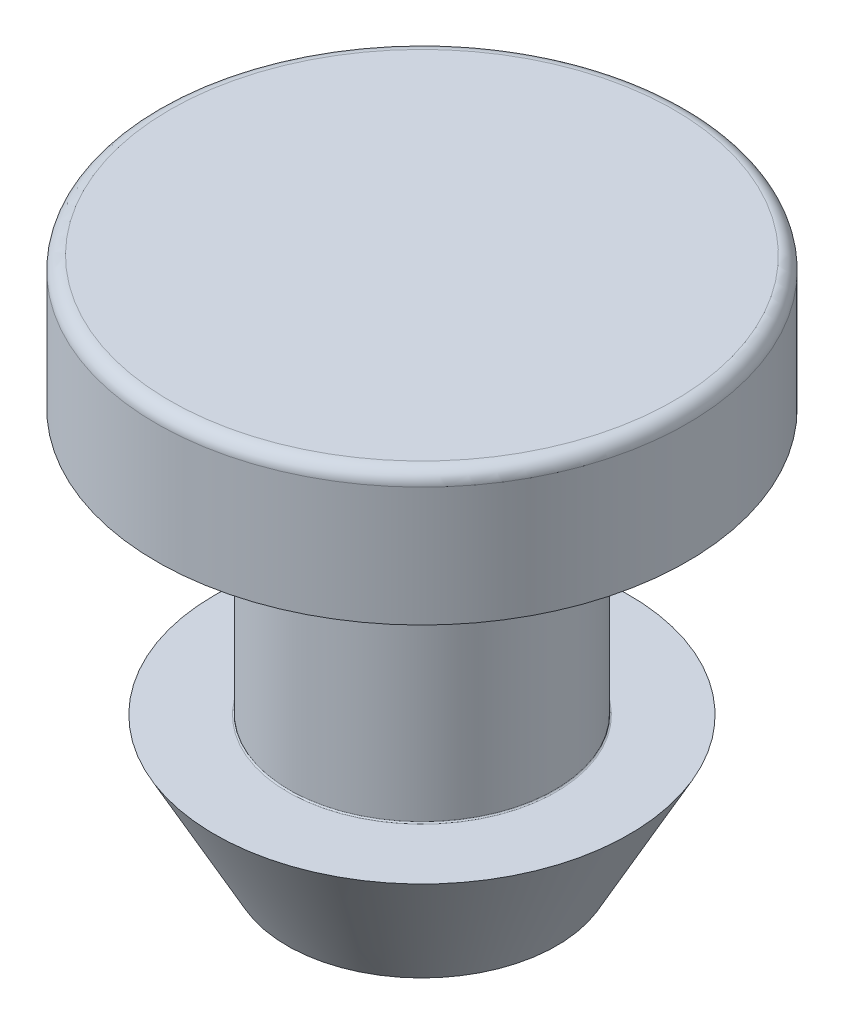
ISO-10303-21;
HEADER;
FILE_DESCRIPTION(('STEP AP214'),'2;1');
FILE_NAME('part.step','',(''),(''),'','','');
FILE_SCHEMA(('AUTOMOTIVE_DESIGN { 1 0 10303 214 1 1 1 1 }'));
ENDSEC;
DATA;
#1=APPLICATION_CONTEXT('core data for automotive mechanical design processes');
#2=APPLICATION_PROTOCOL_DEFINITION('international standard','automotive_design',2000,#1);
#3=PRODUCT_CONTEXT('',#1,'mechanical');
#4=PRODUCT('Part','Part','',(#3));
#5=PRODUCT_RELATED_PRODUCT_CATEGORY('part','',(#4));
#6=PRODUCT_DEFINITION_FORMATION('','',#4);
#7=PRODUCT_DEFINITION_CONTEXT('part definition',#1,'design');
#8=PRODUCT_DEFINITION('design','',#6,#7);
#9=PRODUCT_DEFINITION_SHAPE('','',#8);
#10=(LENGTH_UNIT() NAMED_UNIT(*) SI_UNIT(.MILLI.,.METRE.));
#11=(NAMED_UNIT(*) PLANE_ANGLE_UNIT() SI_UNIT($,.RADIAN.));
#12=(NAMED_UNIT(*) SI_UNIT($,.STERADIAN.) SOLID_ANGLE_UNIT());
#13=UNCERTAINTY_MEASURE_WITH_UNIT(LENGTH_MEASURE(1.E-05),#10,'distance_accuracy_value','');
#14=(GEOMETRIC_REPRESENTATION_CONTEXT(3) GLOBAL_UNCERTAINTY_ASSIGNED_CONTEXT((#13)) GLOBAL_UNIT_ASSIGNED_CONTEXT((#10,
#11,#12)) REPRESENTATION_CONTEXT('',''));
#15=CARTESIAN_POINT('',(0.,0.,0.));
#16=DIRECTION('',(0.,0.,1.));
#17=DIRECTION('',(1.,0.,0.));
#18=AXIS2_PLACEMENT_3D('',#15,#16,#17);
#19=CARTESIAN_POINT('',(6.0325,3.175,0.));
#20=DIRECTION('',(0.,-1.,0.));
#21=DIRECTION('',(1.,0.,0.));
#22=AXIS2_PLACEMENT_3D('',#19,#20,#21);
#23=PLANE('',#22);
#24=CARTESIAN_POINT('',(0.,3.175,0.));
#25=DIRECTION('',(0.,1.,0.));
#26=DIRECTION('',(-1.,0.,0.));
#27=AXIS2_PLACEMENT_3D('',#24,#25,#26);
#28=CIRCLE('',#27,6.0325);
#29=CARTESIAN_POINT('',(-6.0325,3.175,0.));
#30=VERTEX_POINT('',#29);
#31=EDGE_CURVE('E64',#30,#30,#28,.T.);
#32=ORIENTED_EDGE('',*,*,#31,.T.);
#33=EDGE_LOOP('',(#32));
#34=FACE_BOUND('',#33,.T.);
#35=ADVANCED_FACE('F33',(#34),#23,.F.);
#36=CARTESIAN_POINT('',(3.224609375,-9.525,0.));
#37=DIRECTION('',(0.,1.,0.));
#38=DIRECTION('',(-1.,0.,0.));
#39=AXIS2_PLACEMENT_3D('',#36,#37,#38);
#40=PLANE('',#39);
#41=CARTESIAN_POINT('',(0.,-9.525,2.28203125));
#42=DIRECTION('',(0.,-1.,0.));
#43=DIRECTION('',(1.,0.,0.));
#44=AXIS2_PLACEMENT_3D('',#41,#42,#43);
#45=CIRCLE('',#44,0.347265625);
#46=CARTESIAN_POINT('',(0.347265625000001,-9.525,2.28203125));
#47=VERTEX_POINT('',#46);
#48=EDGE_CURVE('E80',#47,#47,#45,.T.);
#49=ORIENTED_EDGE('',*,*,#48,.F.);
#50=EDGE_LOOP('',(#49));
#51=FACE_BOUND('',#50,.T.);
#52=CARTESIAN_POINT('',(1.97629703472996,-9.525,-1.141015625));
#53=DIRECTION('',(0.,-1.,0.));
#54=DIRECTION('',(1.,0.,0.));
#55=AXIS2_PLACEMENT_3D('',#52,#53,#54);
#56=CIRCLE('',#55,0.347265625);
#57=CARTESIAN_POINT('',(2.32356265972996,-9.525,-1.141015625));
#58=VERTEX_POINT('',#57);
#59=EDGE_CURVE('E74',#58,#58,#56,.T.);
#60=ORIENTED_EDGE('',*,*,#59,.F.);
#61=EDGE_LOOP('',(#60));
#62=FACE_BOUND('',#61,.T.);
#63=CARTESIAN_POINT('',(-1.97629703472996,-9.525,-1.141015625));
#64=DIRECTION('',(0.,-1.,0.));
#65=DIRECTION('',(1.,0.,0.));
#66=AXIS2_PLACEMENT_3D('',#63,#64,#65);
#67=CIRCLE('',#66,0.347265625);
#68=CARTESIAN_POINT('',(-1.62903140972996,-9.525,-1.141015625));
#69=VERTEX_POINT('',#68);
#70=EDGE_CURVE('E68',#69,#69,#67,.T.);
#71=ORIENTED_EDGE('',*,*,#70,.F.);
#72=EDGE_LOOP('',(#71));
#73=FACE_BOUND('',#72,.T.);
#74=CARTESIAN_POINT('',(0.,-9.525,0.));
#75=DIRECTION('',(0.,1.,0.));
#76=DIRECTION('',(-1.,0.,0.));
#77=AXIS2_PLACEMENT_3D('',#74,#75,#76);
#78=CIRCLE('',#77,3.224609375);
#79=CARTESIAN_POINT('',(-3.224609375,-9.525,0.));
#80=VERTEX_POINT('',#79);
#81=EDGE_CURVE('E10',#80,#80,#78,.T.);
#82=ORIENTED_EDGE('',*,*,#81,.F.);
#83=EDGE_LOOP('',(#82));
#84=FACE_BOUND('',#83,.T.);
#85=ADVANCED_FACE('F95',(#51,#62,#73,#84),#40,.F.);
#86=CARTESIAN_POINT('',(0.,-9.525,0.));
#87=DIRECTION('',(0.,1.,0.));
#88=DIRECTION('',(-1.,0.,0.));
#89=AXIS2_PLACEMENT_3D('',#86,#87,#88);
#90=CONICAL_SURFACE('',#89,3.224609375,0.500440813147294);
#91=CARTESIAN_POINT('',(0.,-6.35,0.));
#92=DIRECTION('',(0.,1.,0.));
#93=DIRECTION('',(-1.,0.,0.));
#94=AXIS2_PLACEMENT_3D('',#91,#92,#93);
#95=CIRCLE('',#94,4.9609375);
#96=CARTESIAN_POINT('',(-4.9609375,-6.35,0.));
#97=VERTEX_POINT('',#96);
#98=EDGE_CURVE('E39',#97,#97,#95,.T.);
#99=ORIENTED_EDGE('',*,*,#98,.F.);
#100=EDGE_LOOP('',(#99));
#101=FACE_BOUND('',#100,.T.);
#102=ORIENTED_EDGE('',*,*,#81,.T.);
#103=EDGE_LOOP('',(#102));
#104=FACE_BOUND('',#103,.T.);
#105=ADVANCED_FACE('F98',(#101,#104),#90,.T.);
#106=CARTESIAN_POINT('',(3.20675,-6.35,0.));
#107=DIRECTION('',(0.,-1.,0.));
#108=DIRECTION('',(1.,0.,0.));
#109=AXIS2_PLACEMENT_3D('',#106,#107,#108);
#110=PLANE('',#109);
#111=CARTESIAN_POINT('',(0.,-6.35,0.));
#112=DIRECTION('',(0.,1.,0.));
#113=DIRECTION('',(-1.,0.,0.));
#114=AXIS2_PLACEMENT_3D('',#111,#112,#113);
#115=CIRCLE('',#114,3.20675);
#116=CARTESIAN_POINT('',(-3.20675,-6.35,0.));
#117=VERTEX_POINT('',#116);
#118=EDGE_CURVE('E43',#117,#117,#115,.T.);
#119=ORIENTED_EDGE('',*,*,#118,.F.);
#120=EDGE_LOOP('',(#119));
#121=FACE_BOUND('',#120,.T.);
#122=ORIENTED_EDGE('',*,*,#98,.T.);
#123=EDGE_LOOP('',(#122));
#124=FACE_BOUND('',#123,.T.);
#125=ADVANCED_FACE('F155',(#121,#124),#110,.F.);
#126=CARTESIAN_POINT('',(0.,-6.31825,0.));
#127=DIRECTION('',(0.,1.,0.));
#128=DIRECTION('',(-1.,0.,0.));
#129=AXIS2_PLACEMENT_3D('',#126,#127,#128);
#130=TOROIDAL_SURFACE('',#129,3.20675,0.0317500000000003);
#131=CARTESIAN_POINT('',(0.,-6.31825,0.));
#132=DIRECTION('',(0.,1.,0.));
#133=DIRECTION('',(-1.,0.,0.));
#134=AXIS2_PLACEMENT_3D('',#131,#132,#133);
#135=CIRCLE('',#134,3.175);
#136=CARTESIAN_POINT('',(-3.175,-6.31825,0.));
#137=VERTEX_POINT('',#136);
#138=EDGE_CURVE('E47',#137,#137,#135,.T.);
#139=ORIENTED_EDGE('',*,*,#138,.F.);
#140=EDGE_LOOP('',(#139));
#141=FACE_BOUND('',#140,.T.);
#142=ORIENTED_EDGE('',*,*,#118,.T.);
#143=EDGE_LOOP('',(#142));
#144=FACE_BOUND('',#143,.T.);
#145=ADVANCED_FACE('F149',(#141,#144),#130,.F.);
#146=CARTESIAN_POINT('',(0.,3.175,0.));
#147=DIRECTION('',(0.,1.,0.));
#148=DIRECTION('',(-1.,0.,0.));
#149=AXIS2_PLACEMENT_3D('',#146,#147,#148);
#150=CYLINDRICAL_SURFACE('',#149,3.175);
#151=CARTESIAN_POINT('',(0.,-0.031750000000001,0.));
#152=DIRECTION('',(0.,1.,0.));
#153=DIRECTION('',(-1.,0.,0.));
#154=AXIS2_PLACEMENT_3D('',#151,#152,#153);
#155=CIRCLE('',#154,3.175);
#156=CARTESIAN_POINT('',(-3.175,-0.0317500000000012,0.));
#157=VERTEX_POINT('',#156);
#158=EDGE_CURVE('E52',#157,#157,#155,.T.);
#159=ORIENTED_EDGE('',*,*,#158,.F.);
#160=EDGE_LOOP('',(#159));
#161=FACE_BOUND('',#160,.T.);
#162=ORIENTED_EDGE('',*,*,#138,.T.);
#163=EDGE_LOOP('',(#162));
#164=FACE_BOUND('',#163,.T.);
#165=ADVANCED_FACE('F143',(#161,#164),#150,.T.);
#166=CARTESIAN_POINT('',(0.,-0.0317500000000008,0.));
#167=DIRECTION('',(0.,1.,0.));
#168=DIRECTION('',(-1.,0.,0.));
#169=AXIS2_PLACEMENT_3D('',#166,#167,#168);
#170=TOROIDAL_SURFACE('',#169,3.20675,0.0317500000000001);
#171=CARTESIAN_POINT('',(0.,0.,0.));
#172=DIRECTION('',(0.,1.,0.));
#173=DIRECTION('',(-1.,0.,0.));
#174=AXIS2_PLACEMENT_3D('',#171,#172,#173);
#175=CIRCLE('',#174,3.20675);
#176=CARTESIAN_POINT('',(-3.20675,0.,0.));
#177=VERTEX_POINT('',#176);
#178=EDGE_CURVE('E55',#177,#177,#175,.T.);
#179=ORIENTED_EDGE('',*,*,#178,.F.);
#180=EDGE_LOOP('',(#179));
#181=FACE_BOUND('',#180,.T.);
#182=ORIENTED_EDGE('',*,*,#158,.T.);
#183=EDGE_LOOP('',(#182));
#184=FACE_BOUND('',#183,.T.);
#185=ADVANCED_FACE('F137',(#181,#184),#170,.F.);
#186=CARTESIAN_POINT('',(6.35,0.,0.));
#187=DIRECTION('',(0.,1.,0.));
#188=DIRECTION('',(-1.,0.,0.));
#189=AXIS2_PLACEMENT_3D('',#186,#187,#188);
#190=PLANE('',#189);
#191=CARTESIAN_POINT('',(0.,0.,0.));
#192=DIRECTION('',(0.,1.,0.));
#193=DIRECTION('',(-1.,0.,0.));
#194=AXIS2_PLACEMENT_3D('',#191,#192,#193);
#195=CIRCLE('',#194,6.35);
#196=CARTESIAN_POINT('',(-6.35,0.,0.));
#197=VERTEX_POINT('',#196);
#198=EDGE_CURVE('E58',#197,#197,#195,.T.);
#199=ORIENTED_EDGE('',*,*,#198,.F.);
#200=EDGE_LOOP('',(#199));
#201=FACE_BOUND('',#200,.T.);
#202=ORIENTED_EDGE('',*,*,#178,.T.);
#203=EDGE_LOOP('',(#202));
#204=FACE_BOUND('',#203,.T.);
#205=ADVANCED_FACE('F131',(#201,#204),#190,.F.);
#206=CARTESIAN_POINT('',(0.,3.175,0.));
#207=DIRECTION('',(0.,1.,0.));
#208=DIRECTION('',(-1.,0.,0.));
#209=AXIS2_PLACEMENT_3D('',#206,#207,#208);
#210=CYLINDRICAL_SURFACE('',#209,6.35);
#211=CARTESIAN_POINT('',(0.,2.8575,0.));
#212=DIRECTION('',(0.,1.,0.));
#213=DIRECTION('',(-1.,0.,0.));
#214=AXIS2_PLACEMENT_3D('',#211,#212,#213);
#215=CIRCLE('',#214,6.35);
#216=CARTESIAN_POINT('',(-6.35,2.8575,0.));
#217=VERTEX_POINT('',#216);
#218=EDGE_CURVE('E61',#217,#217,#215,.T.);
#219=ORIENTED_EDGE('',*,*,#218,.F.);
#220=EDGE_LOOP('',(#219));
#221=FACE_BOUND('',#220,.T.);
#222=ORIENTED_EDGE('',*,*,#198,.T.);
#223=EDGE_LOOP('',(#222));
#224=FACE_BOUND('',#223,.T.);
#225=ADVANCED_FACE('F117',(#221,#224),#210,.T.);
#226=CARTESIAN_POINT('',(0.,2.8575,0.));
#227=DIRECTION('',(0.,1.,0.));
#228=DIRECTION('',(-1.,0.,0.));
#229=AXIS2_PLACEMENT_3D('',#226,#227,#228);
#230=TOROIDAL_SURFACE('',#229,6.0325,0.3175);
#231=ORIENTED_EDGE('',*,*,#31,.F.);
#232=EDGE_LOOP('',(#231));
#233=FACE_BOUND('',#232,.T.);
#234=ORIENTED_EDGE('',*,*,#218,.T.);
#235=EDGE_LOOP('',(#234));
#236=FACE_BOUND('',#235,.T.);
#237=ADVANCED_FACE('F107',(#233,#236),#230,.T.);
#238=CARTESIAN_POINT('',(-1.97629703472996,-9.2075,-1.141015625));
#239=DIRECTION('',(0.,-1.,0.));
#240=DIRECTION('',(1.,0.,0.));
#241=AXIS2_PLACEMENT_3D('',#238,#239,#240);
#242=CYLINDRICAL_SURFACE('',#241,0.347265625);
#243=CARTESIAN_POINT('',(-1.97629703472996,-9.2075,-1.141015625));
#244=DIRECTION('',(0.,-1.,0.));
#245=DIRECTION('',(1.,0.,0.));
#246=AXIS2_PLACEMENT_3D('',#243,#244,#245);
#247=CIRCLE('',#246,0.347265625);
#248=CARTESIAN_POINT('',(-1.62903140972996,-9.2075,-1.141015625));
#249=VERTEX_POINT('',#248);
#250=EDGE_CURVE('E71',#249,#249,#247,.T.);
#251=ORIENTED_EDGE('',*,*,#250,.F.);
#252=EDGE_LOOP('',(#251));
#253=FACE_BOUND('',#252,.T.);
#254=ORIENTED_EDGE('',*,*,#70,.T.);
#255=EDGE_LOOP('',(#254));
#256=FACE_BOUND('',#255,.T.);
#257=ADVANCED_FACE('F104',(#253,#256),#242,.F.);
#258=CARTESIAN_POINT('',(-1.97629703472996,-9.2075,-1.141015625));
#259=DIRECTION('',(0.,-1.,0.));
#260=DIRECTION('',(1.,0.,0.));
#261=AXIS2_PLACEMENT_3D('',#258,#259,#260);
#262=PLANE('',#261);
#263=ORIENTED_EDGE('',*,*,#250,.T.);
#264=EDGE_LOOP('',(#263));
#265=FACE_BOUND('',#264,.T.);
#266=ADVANCED_FACE('F106',(#265),#262,.T.);
#267=CARTESIAN_POINT('',(1.97629703472996,-9.2075,-1.141015625));
#268=DIRECTION('',(0.,-1.,0.));
#269=DIRECTION('',(1.,0.,0.));
#270=AXIS2_PLACEMENT_3D('',#267,#268,#269);
#271=CYLINDRICAL_SURFACE('',#270,0.347265625);
#272=CARTESIAN_POINT('',(1.97629703472996,-9.2075,-1.141015625));
#273=DIRECTION('',(0.,-1.,0.));
#274=DIRECTION('',(1.,0.,0.));
#275=AXIS2_PLACEMENT_3D('',#272,#273,#274);
#276=CIRCLE('',#275,0.347265625);
#277=CARTESIAN_POINT('',(2.32356265972996,-9.2075,-1.141015625));
#278=VERTEX_POINT('',#277);
#279=EDGE_CURVE('E77',#278,#278,#276,.T.);
#280=ORIENTED_EDGE('',*,*,#279,.F.);
#281=EDGE_LOOP('',(#280));
#282=FACE_BOUND('',#281,.T.);
#283=ORIENTED_EDGE('',*,*,#59,.T.);
#284=EDGE_LOOP('',(#283));
#285=FACE_BOUND('',#284,.T.);
#286=ADVANCED_FACE('F114',(#282,#285),#271,.F.);
#287=CARTESIAN_POINT('',(1.97629703472996,-9.2075,-1.141015625));
#288=DIRECTION('',(0.,-1.,0.));
#289=DIRECTION('',(1.,0.,0.));
#290=AXIS2_PLACEMENT_3D('',#287,#288,#289);
#291=PLANE('',#290);
#292=ORIENTED_EDGE('',*,*,#279,.T.);
#293=EDGE_LOOP('',(#292));
#294=FACE_BOUND('',#293,.T.);
#295=ADVANCED_FACE('F91',(#294),#291,.T.);
#296=CARTESIAN_POINT('',(0.,-9.2075,2.28203125));
#297=DIRECTION('',(0.,-1.,0.));
#298=DIRECTION('',(1.,0.,0.));
#299=AXIS2_PLACEMENT_3D('',#296,#297,#298);
#300=CYLINDRICAL_SURFACE('',#299,0.347265625);
#301=CARTESIAN_POINT('',(0.,-9.2075,2.28203125));
#302=DIRECTION('',(0.,-1.,0.));
#303=DIRECTION('',(1.,0.,0.));
#304=AXIS2_PLACEMENT_3D('',#301,#302,#303);
#305=CIRCLE('',#304,0.347265625);
#306=CARTESIAN_POINT('',(0.347265625000001,-9.2075,2.28203125));
#307=VERTEX_POINT('',#306);
#308=EDGE_CURVE('E67',#307,#307,#305,.T.);
#309=ORIENTED_EDGE('',*,*,#308,.F.);
#310=EDGE_LOOP('',(#309));
#311=FACE_BOUND('',#310,.T.);
#312=ORIENTED_EDGE('',*,*,#48,.T.);
#313=EDGE_LOOP('',(#312));
#314=FACE_BOUND('',#313,.T.);
#315=ADVANCED_FACE('F88',(#311,#314),#300,.F.);
#316=CARTESIAN_POINT('',(0.,-9.2075,2.28203125));
#317=DIRECTION('',(0.,-1.,0.));
#318=DIRECTION('',(1.,0.,0.));
#319=AXIS2_PLACEMENT_3D('',#316,#317,#318);
#320=PLANE('',#319);
#321=ORIENTED_EDGE('',*,*,#308,.T.);
#322=EDGE_LOOP('',(#321));
#323=FACE_BOUND('',#322,.T.);
#324=ADVANCED_FACE('F86',(#323),#320,.T.);
#325=CLOSED_SHELL('',(#35,#85,#105,#125,#145,#165,#185,#205,#225,#237,#257,#266,#286,#295,#315,#324));
#326=MANIFOLD_SOLID_BREP('B2',#325);
#327=ADVANCED_BREP_SHAPE_REPRESENTATION('',(#18,#326),#14);
#328=SHAPE_DEFINITION_REPRESENTATION(#9,#327);
ENDSEC;
END-ISO-10303-21;
